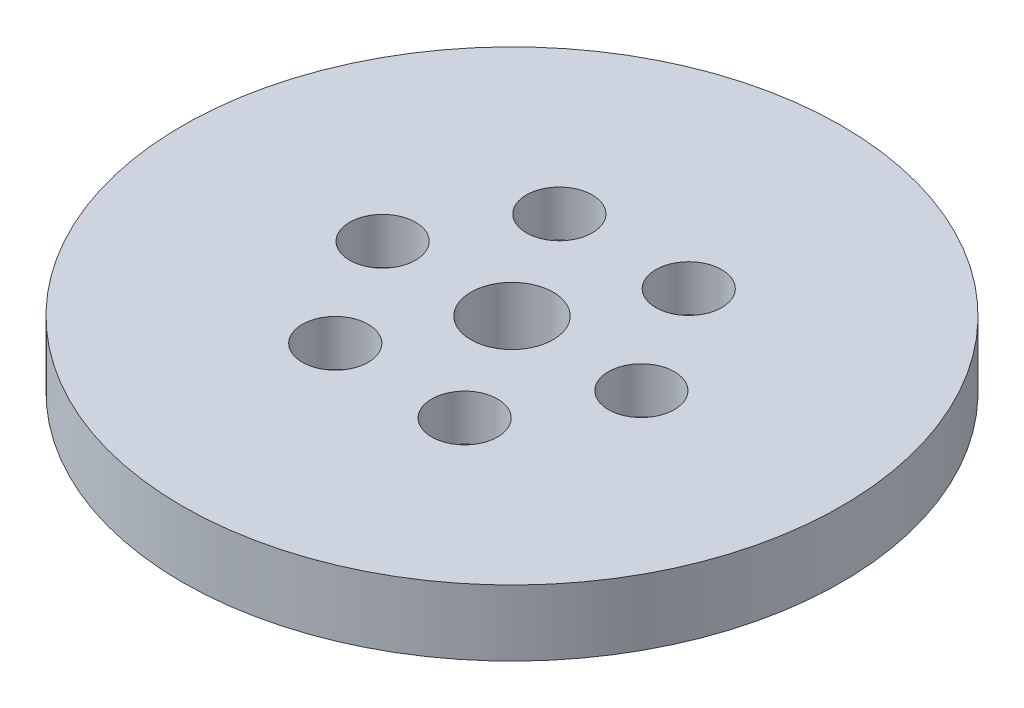
ISO-10303-21;
HEADER;
FILE_DESCRIPTION(('STEP AP214'),'2;1');
FILE_NAME('part.step','',(''),(''),'','','');
FILE_SCHEMA(('AUTOMOTIVE_DESIGN { 1 0 10303 214 1 1 1 1 }'));
ENDSEC;
DATA;
#1=APPLICATION_CONTEXT('core data for automotive mechanical design processes');
#2=APPLICATION_PROTOCOL_DEFINITION('international standard','automotive_design',2000,#1);
#3=PRODUCT_CONTEXT('',#1,'mechanical');
#4=PRODUCT('Part','Part','',(#3));
#5=PRODUCT_RELATED_PRODUCT_CATEGORY('part','',(#4));
#6=PRODUCT_DEFINITION_FORMATION('','',#4);
#7=PRODUCT_DEFINITION_CONTEXT('part definition',#1,'design');
#8=PRODUCT_DEFINITION('design','',#6,#7);
#9=PRODUCT_DEFINITION_SHAPE('','',#8);
#10=(LENGTH_UNIT() NAMED_UNIT(*) SI_UNIT(.MILLI.,.METRE.));
#11=(NAMED_UNIT(*) PLANE_ANGLE_UNIT() SI_UNIT($,.RADIAN.));
#12=(NAMED_UNIT(*) SI_UNIT($,.STERADIAN.) SOLID_ANGLE_UNIT());
#13=UNCERTAINTY_MEASURE_WITH_UNIT(LENGTH_MEASURE(1.E-05),#10,'distance_accuracy_value','');
#14=(GEOMETRIC_REPRESENTATION_CONTEXT(3) GLOBAL_UNCERTAINTY_ASSIGNED_CONTEXT((#13)) GLOBAL_UNIT_ASSIGNED_CONTEXT((#10,
#11,#12)) REPRESENTATION_CONTEXT('',''));
#15=CARTESIAN_POINT('',(0.,0.,0.));
#16=DIRECTION('',(0.,0.,1.));
#17=DIRECTION('',(1.,0.,0.));
#18=AXIS2_PLACEMENT_3D('',#15,#16,#17);
#19=CARTESIAN_POINT('',(0.,20.,0.));
#20=DIRECTION('',(0.,-1.,0.));
#21=DIRECTION('',(0.,0.,-1.));
#22=AXIS2_PLACEMENT_3D('',#19,#20,#21);
#23=CYLINDRICAL_SURFACE('',#22,100.);
#24=CARTESIAN_POINT('',(0.,20.,0.));
#25=DIRECTION('',(0.,1.,0.));
#26=DIRECTION('',(0.,0.,1.));
#27=AXIS2_PLACEMENT_3D('',#24,#25,#26);
#28=CIRCLE('',#27,100.);
#29=CARTESIAN_POINT('',(0.,20.,100.));
#30=VERTEX_POINT('',#29);
#31=EDGE_CURVE('E10',#30,#30,#28,.T.);
#32=ORIENTED_EDGE('',*,*,#31,.F.);
#33=EDGE_LOOP('',(#32));
#34=FACE_BOUND('',#33,.T.);
#35=CARTESIAN_POINT('',(0.,0.,0.));
#36=DIRECTION('',(0.,1.,0.));
#37=DIRECTION('',(0.,0.,1.));
#38=AXIS2_PLACEMENT_3D('',#35,#36,#37);
#39=CIRCLE('',#38,100.);
#40=CARTESIAN_POINT('',(0.,0.,100.));
#41=VERTEX_POINT('',#40);
#42=EDGE_CURVE('E37',#41,#41,#39,.T.);
#43=ORIENTED_EDGE('',*,*,#42,.T.);
#44=EDGE_LOOP('',(#43));
#45=FACE_BOUND('',#44,.T.);
#46=ADVANCED_FACE('F40',(#34,#45),#23,.T.);
#47=CARTESIAN_POINT('',(0.,20.,0.));
#48=DIRECTION('',(0.,1.,0.));
#49=DIRECTION('',(0.,0.,1.));
#50=AXIS2_PLACEMENT_3D('',#47,#48,#49);
#51=PLANE('',#50);
#52=CARTESIAN_POINT('',(-19.6299319447352,20.,-34.0000394773998));
#53=DIRECTION('',(0.,1.,0.));
#54=DIRECTION('',(-0.866025403784433,0.,0.50000000000001));
#55=AXIS2_PLACEMENT_3D('',#52,#53,#54);
#56=CIRCLE('',#55,10.);
#57=CARTESIAN_POINT('',(-28.2901859825795,20.,-29.0000394773997));
#58=VERTEX_POINT('',#57);
#59=EDGE_CURVE('E70',#58,#58,#56,.T.);
#60=ORIENTED_EDGE('',*,*,#59,.F.);
#61=EDGE_LOOP('',(#60));
#62=FACE_BOUND('',#61,.T.);
#63=CARTESIAN_POINT('',(19.6299319447345,20.,-34.0000394774002));
#64=DIRECTION('',(0.,1.,0.));
#65=DIRECTION('',(-0.866025403784443,0.,-0.499999999999992));
#66=AXIS2_PLACEMENT_3D('',#63,#64,#65);
#67=CIRCLE('',#66,10.);
#68=CARTESIAN_POINT('',(10.9696779068901,20.,-39.0000394774001));
#69=VERTEX_POINT('',#68);
#70=EDGE_CURVE('E71',#69,#69,#67,.T.);
#71=ORIENTED_EDGE('',*,*,#70,.F.);
#72=EDGE_LOOP('',(#71));
#73=FACE_BOUND('',#72,.T.);
#74=CARTESIAN_POINT('',(39.2598638894696,20.,0.));
#75=DIRECTION('',(0.,1.,0.));
#76=DIRECTION('',(0.,0.,-1.));
#77=AXIS2_PLACEMENT_3D('',#74,#75,#76);
#78=CIRCLE('',#77,10.);
#79=CARTESIAN_POINT('',(39.2598638894696,20.,-10.));
#80=VERTEX_POINT('',#79);
#81=EDGE_CURVE('E78',#80,#80,#78,.T.);
#82=ORIENTED_EDGE('',*,*,#81,.F.);
#83=EDGE_LOOP('',(#82));
#84=FACE_BOUND('',#83,.T.);
#85=CARTESIAN_POINT('',(19.629931944735,20.,34.0000394773999));
#86=DIRECTION('',(0.,1.,0.));
#87=DIRECTION('',(0.866025403784436,0.,-0.500000000000004));
#88=AXIS2_PLACEMENT_3D('',#85,#86,#87);
#89=CIRCLE('',#88,10.);
#90=CARTESIAN_POINT('',(28.2901859825793,20.,29.0000394773999));
#91=VERTEX_POINT('',#90);
#92=EDGE_CURVE('E84',#91,#91,#89,.T.);
#93=ORIENTED_EDGE('',*,*,#92,.F.);
#94=EDGE_LOOP('',(#93));
#95=FACE_BOUND('',#94,.T.);
#96=CARTESIAN_POINT('',(-19.6299319447347,20.,34.0000394774001));
#97=DIRECTION('',(0.,1.,0.));
#98=DIRECTION('',(0.86602540378444,0.,0.499999999999998));
#99=AXIS2_PLACEMENT_3D('',#96,#97,#98);
#100=CIRCLE('',#99,10.);
#101=CARTESIAN_POINT('',(-10.9696779068903,20.,39.0000394774001));
#102=VERTEX_POINT('',#101);
#103=EDGE_CURVE('E61',#102,#102,#100,.T.);
#104=ORIENTED_EDGE('',*,*,#103,.F.);
#105=EDGE_LOOP('',(#104));
#106=FACE_BOUND('',#105,.T.);
#107=CARTESIAN_POINT('',(-39.2598638894696,20.,0.));
#108=DIRECTION('',(0.,1.,0.));
#109=DIRECTION('',(0.,0.,1.));
#110=AXIS2_PLACEMENT_3D('',#107,#108,#109);
#111=CIRCLE('',#110,10.);
#112=CARTESIAN_POINT('',(-39.2598638894696,20.,10.));
#113=VERTEX_POINT('',#112);
#114=EDGE_CURVE('E54',#113,#113,#111,.T.);
#115=ORIENTED_EDGE('',*,*,#114,.F.);
#116=EDGE_LOOP('',(#115));
#117=FACE_BOUND('',#116,.T.);
#118=CARTESIAN_POINT('',(0.,20.,0.));
#119=DIRECTION('',(0.,1.,0.));
#120=DIRECTION('',(0.,0.,1.));
#121=AXIS2_PLACEMENT_3D('',#118,#119,#120);
#122=CIRCLE('',#121,12.5);
#123=CARTESIAN_POINT('',(0.,20.,12.5));
#124=VERTEX_POINT('',#123);
#125=EDGE_CURVE('E50',#124,#124,#122,.T.);
#126=ORIENTED_EDGE('',*,*,#125,.F.);
#127=EDGE_LOOP('',(#126));
#128=FACE_BOUND('',#127,.T.);
#129=ORIENTED_EDGE('',*,*,#31,.T.);
#130=EDGE_LOOP('',(#129));
#131=FACE_BOUND('',#130,.T.);
#132=ADVANCED_FACE('F99',(#62,#73,#84,#95,#106,#117,#128,#131),#51,.T.);
#133=CARTESIAN_POINT('',(0.,0.,0.));
#134=DIRECTION('',(0.,1.,0.));
#135=DIRECTION('',(0.,0.,1.));
#136=AXIS2_PLACEMENT_3D('',#133,#134,#135);
#137=PLANE('',#136);
#138=CARTESIAN_POINT('',(0.,0.,0.));
#139=DIRECTION('',(0.,1.,0.));
#140=DIRECTION('',(0.,0.,1.));
#141=AXIS2_PLACEMENT_3D('',#138,#139,#140);
#142=CIRCLE('',#141,12.5);
#143=CARTESIAN_POINT('',(0.,0.,12.5));
#144=VERTEX_POINT('',#143);
#145=EDGE_CURVE('E47',#144,#144,#142,.T.);
#146=ORIENTED_EDGE('',*,*,#145,.T.);
#147=EDGE_LOOP('',(#146));
#148=FACE_BOUND('',#147,.T.);
#149=ORIENTED_EDGE('',*,*,#42,.F.);
#150=EDGE_LOOP('',(#149));
#151=FACE_BOUND('',#150,.T.);
#152=ADVANCED_FACE('F103',(#148,#151),#137,.F.);
#153=CARTESIAN_POINT('',(0.,20.,0.));
#154=DIRECTION('',(0.,-1.,0.));
#155=DIRECTION('',(0.,0.,-1.));
#156=AXIS2_PLACEMENT_3D('',#153,#154,#155);
#157=CYLINDRICAL_SURFACE('',#156,12.5);
#158=ORIENTED_EDGE('',*,*,#125,.T.);
#159=EDGE_LOOP('',(#158));
#160=FACE_BOUND('',#159,.T.);
#161=ORIENTED_EDGE('',*,*,#145,.F.);
#162=EDGE_LOOP('',(#161));
#163=FACE_BOUND('',#162,.T.);
#164=ADVANCED_FACE('F115',(#160,#163),#157,.F.);
#165=CARTESIAN_POINT('',(-39.2598638894696,6.07585861774359,0.));
#166=DIRECTION('',(0.,1.,0.));
#167=DIRECTION('',(0.,0.,1.));
#168=AXIS2_PLACEMENT_3D('',#165,#166,#167);
#169=CYLINDRICAL_SURFACE('',#168,10.);
#170=CARTESIAN_POINT('',(-39.2598638894696,6.07585861774359,0.));
#171=DIRECTION('',(0.,1.,0.));
#172=DIRECTION('',(0.,0.,1.));
#173=AXIS2_PLACEMENT_3D('',#170,#171,#172);
#174=CIRCLE('',#173,10.);
#175=CARTESIAN_POINT('',(-39.2598638894696,6.07585861774359,10.));
#176=VERTEX_POINT('',#175);
#177=EDGE_CURVE('E55',#176,#176,#174,.T.);
#178=ORIENTED_EDGE('',*,*,#177,.F.);
#179=EDGE_LOOP('',(#178));
#180=FACE_BOUND('',#179,.T.);
#181=ORIENTED_EDGE('',*,*,#114,.T.);
#182=EDGE_LOOP('',(#181));
#183=FACE_BOUND('',#182,.T.);
#184=ADVANCED_FACE('F113',(#180,#183),#169,.F.);
#185=CARTESIAN_POINT('',(-39.2598638894696,6.07585861774359,0.));
#186=DIRECTION('',(0.,1.,0.));
#187=DIRECTION('',(0.,0.,1.));
#188=AXIS2_PLACEMENT_3D('',#185,#186,#187);
#189=PLANE('',#188);
#190=ORIENTED_EDGE('',*,*,#177,.T.);
#191=EDGE_LOOP('',(#190));
#192=FACE_BOUND('',#191,.T.);
#193=ADVANCED_FACE('F144',(#192),#189,.T.);
#194=CARTESIAN_POINT('',(-19.6299319447347,6.07585861774359,34.0000394774001));
#195=DIRECTION('',(0.,1.,0.));
#196=DIRECTION('',(0.,0.,1.));
#197=AXIS2_PLACEMENT_3D('',#194,#195,#196);
#198=CYLINDRICAL_SURFACE('',#197,10.);
#199=CARTESIAN_POINT('',(-19.6299319447347,6.07585861774359,34.0000394774001));
#200=DIRECTION('',(0.,1.,0.));
#201=DIRECTION('',(0.86602540378444,0.,0.499999999999998));
#202=AXIS2_PLACEMENT_3D('',#199,#200,#201);
#203=CIRCLE('',#202,10.);
#204=CARTESIAN_POINT('',(-10.9696779068903,6.07585861774359,39.0000394774001));
#205=VERTEX_POINT('',#204);
#206=EDGE_CURVE('E59',#205,#205,#203,.T.);
#207=ORIENTED_EDGE('',*,*,#206,.F.);
#208=EDGE_LOOP('',(#207));
#209=FACE_BOUND('',#208,.T.);
#210=ORIENTED_EDGE('',*,*,#103,.T.);
#211=EDGE_LOOP('',(#210));
#212=FACE_BOUND('',#211,.T.);
#213=ADVANCED_FACE('F153',(#209,#212),#198,.F.);
#214=CARTESIAN_POINT('',(-19.6299319447347,6.07585861774359,34.0000394774001));
#215=DIRECTION('',(0.,1.,0.));
#216=DIRECTION('',(0.86602540378444,0.,0.499999999999998));
#217=AXIS2_PLACEMENT_3D('',#214,#215,#216);
#218=PLANE('',#217);
#219=ORIENTED_EDGE('',*,*,#206,.T.);
#220=EDGE_LOOP('',(#219));
#221=FACE_BOUND('',#220,.T.);
#222=ADVANCED_FACE('F96',(#221),#218,.T.);
#223=CARTESIAN_POINT('',(19.629931944735,6.07585861774359,34.0000394773999));
#224=DIRECTION('',(0.,1.,0.));
#225=DIRECTION('',(0.,0.,1.));
#226=AXIS2_PLACEMENT_3D('',#223,#224,#225);
#227=CYLINDRICAL_SURFACE('',#226,10.);
#228=CARTESIAN_POINT('',(19.629931944735,6.07585861774359,34.0000394773999));
#229=DIRECTION('',(0.,1.,0.));
#230=DIRECTION('',(0.866025403784436,0.,-0.500000000000004));
#231=AXIS2_PLACEMENT_3D('',#228,#229,#230);
#232=CIRCLE('',#231,10.);
#233=CARTESIAN_POINT('',(28.2901859825793,6.07585861774359,29.0000394773999));
#234=VERTEX_POINT('',#233);
#235=EDGE_CURVE('E63',#234,#234,#232,.T.);
#236=ORIENTED_EDGE('',*,*,#235,.F.);
#237=EDGE_LOOP('',(#236));
#238=FACE_BOUND('',#237,.T.);
#239=ORIENTED_EDGE('',*,*,#92,.T.);
#240=EDGE_LOOP('',(#239));
#241=FACE_BOUND('',#240,.T.);
#242=ADVANCED_FACE('F91',(#238,#241),#227,.F.);
#243=CARTESIAN_POINT('',(19.629931944735,6.07585861774359,34.0000394773999));
#244=DIRECTION('',(0.,1.,0.));
#245=DIRECTION('',(0.866025403784436,0.,-0.500000000000004));
#246=AXIS2_PLACEMENT_3D('',#243,#244,#245);
#247=PLANE('',#246);
#248=ORIENTED_EDGE('',*,*,#235,.T.);
#249=EDGE_LOOP('',(#248));
#250=FACE_BOUND('',#249,.T.);
#251=ADVANCED_FACE('F93',(#250),#247,.T.);
#252=CARTESIAN_POINT('',(39.2598638894696,6.07585861774359,0.));
#253=DIRECTION('',(0.,1.,0.));
#254=DIRECTION('',(0.,0.,1.));
#255=AXIS2_PLACEMENT_3D('',#252,#253,#254);
#256=CYLINDRICAL_SURFACE('',#255,10.);
#257=CARTESIAN_POINT('',(39.2598638894696,6.07585861774359,0.));
#258=DIRECTION('',(0.,1.,0.));
#259=DIRECTION('',(0.,0.,-1.));
#260=AXIS2_PLACEMENT_3D('',#257,#258,#259);
#261=CIRCLE('',#260,10.);
#262=CARTESIAN_POINT('',(39.2598638894696,6.07585861774359,-10.));
#263=VERTEX_POINT('',#262);
#264=EDGE_CURVE('E85',#263,#263,#261,.T.);
#265=ORIENTED_EDGE('',*,*,#264,.F.);
#266=EDGE_LOOP('',(#265));
#267=FACE_BOUND('',#266,.T.);
#268=ORIENTED_EDGE('',*,*,#81,.T.);
#269=EDGE_LOOP('',(#268));
#270=FACE_BOUND('',#269,.T.);
#271=ADVANCED_FACE('F187',(#267,#270),#256,.F.);
#272=CARTESIAN_POINT('',(39.2598638894696,6.07585861774359,0.));
#273=DIRECTION('',(0.,1.,0.));
#274=DIRECTION('',(0.,0.,-1.));
#275=AXIS2_PLACEMENT_3D('',#272,#273,#274);
#276=PLANE('',#275);
#277=ORIENTED_EDGE('',*,*,#264,.T.);
#278=EDGE_LOOP('',(#277));
#279=FACE_BOUND('',#278,.T.);
#280=ADVANCED_FACE('F198',(#279),#276,.T.);
#281=CARTESIAN_POINT('',(19.6299319447345,6.07585861774359,-34.0000394774002));
#282=DIRECTION('',(0.,1.,0.));
#283=DIRECTION('',(0.,0.,1.));
#284=AXIS2_PLACEMENT_3D('',#281,#282,#283);
#285=CYLINDRICAL_SURFACE('',#284,10.);
#286=CARTESIAN_POINT('',(19.6299319447345,6.07585861774359,-34.0000394774002));
#287=DIRECTION('',(0.,1.,0.));
#288=DIRECTION('',(-0.866025403784443,0.,-0.499999999999992));
#289=AXIS2_PLACEMENT_3D('',#286,#287,#288);
#290=CIRCLE('',#289,10.);
#291=CARTESIAN_POINT('',(10.9696779068901,6.07585861774359,-39.0000394774001));
#292=VERTEX_POINT('',#291);
#293=EDGE_CURVE('E76',#292,#292,#290,.T.);
#294=ORIENTED_EDGE('',*,*,#293,.F.);
#295=EDGE_LOOP('',(#294));
#296=FACE_BOUND('',#295,.T.);
#297=ORIENTED_EDGE('',*,*,#70,.T.);
#298=EDGE_LOOP('',(#297));
#299=FACE_BOUND('',#298,.T.);
#300=ADVANCED_FACE('F202',(#296,#299),#285,.F.);
#301=CARTESIAN_POINT('',(19.6299319447345,6.07585861774359,-34.0000394774002));
#302=DIRECTION('',(0.,1.,0.));
#303=DIRECTION('',(-0.866025403784443,0.,-0.499999999999992));
#304=AXIS2_PLACEMENT_3D('',#301,#302,#303);
#305=PLANE('',#304);
#306=ORIENTED_EDGE('',*,*,#293,.T.);
#307=EDGE_LOOP('',(#306));
#308=FACE_BOUND('',#307,.T.);
#309=ADVANCED_FACE('F212',(#308),#305,.T.);
#310=CARTESIAN_POINT('',(-19.6299319447352,6.07585861774359,-34.0000394773998));
#311=DIRECTION('',(0.,1.,0.));
#312=DIRECTION('',(0.,0.,1.));
#313=AXIS2_PLACEMENT_3D('',#310,#311,#312);
#314=CYLINDRICAL_SURFACE('',#313,10.);
#315=CARTESIAN_POINT('',(-19.6299319447352,6.07585861774359,-34.0000394773998));
#316=DIRECTION('',(0.,1.,0.));
#317=DIRECTION('',(-0.866025403784433,0.,0.50000000000001));
#318=AXIS2_PLACEMENT_3D('',#315,#316,#317);
#319=CIRCLE('',#318,10.);
#320=CARTESIAN_POINT('',(-28.2901859825795,6.07585861774359,-29.0000394773997));
#321=VERTEX_POINT('',#320);
#322=EDGE_CURVE('E69',#321,#321,#319,.T.);
#323=ORIENTED_EDGE('',*,*,#322,.F.);
#324=EDGE_LOOP('',(#323));
#325=FACE_BOUND('',#324,.T.);
#326=ORIENTED_EDGE('',*,*,#59,.T.);
#327=EDGE_LOOP('',(#326));
#328=FACE_BOUND('',#327,.T.);
#329=ADVANCED_FACE('F224',(#325,#328),#314,.F.);
#330=CARTESIAN_POINT('',(-19.6299319447352,6.07585861774359,-34.0000394773998));
#331=DIRECTION('',(0.,1.,0.));
#332=DIRECTION('',(-0.866025403784433,0.,0.50000000000001));
#333=AXIS2_PLACEMENT_3D('',#330,#331,#332);
#334=PLANE('',#333);
#335=ORIENTED_EDGE('',*,*,#322,.T.);
#336=EDGE_LOOP('',(#335));
#337=FACE_BOUND('',#336,.T.);
#338=ADVANCED_FACE('F235',(#337),#334,.T.);
#339=CLOSED_SHELL('',(#46,#132,#152,#164,#184,#193,#213,#222,#242,#251,#271,#280,#300,#309,#329,#338));
#340=MANIFOLD_SOLID_BREP('B2',#339);
#341=ADVANCED_BREP_SHAPE_REPRESENTATION('',(#18,#340),#14);
#342=SHAPE_DEFINITION_REPRESENTATION(#9,#341);
ENDSEC;
END-ISO-10303-21;
